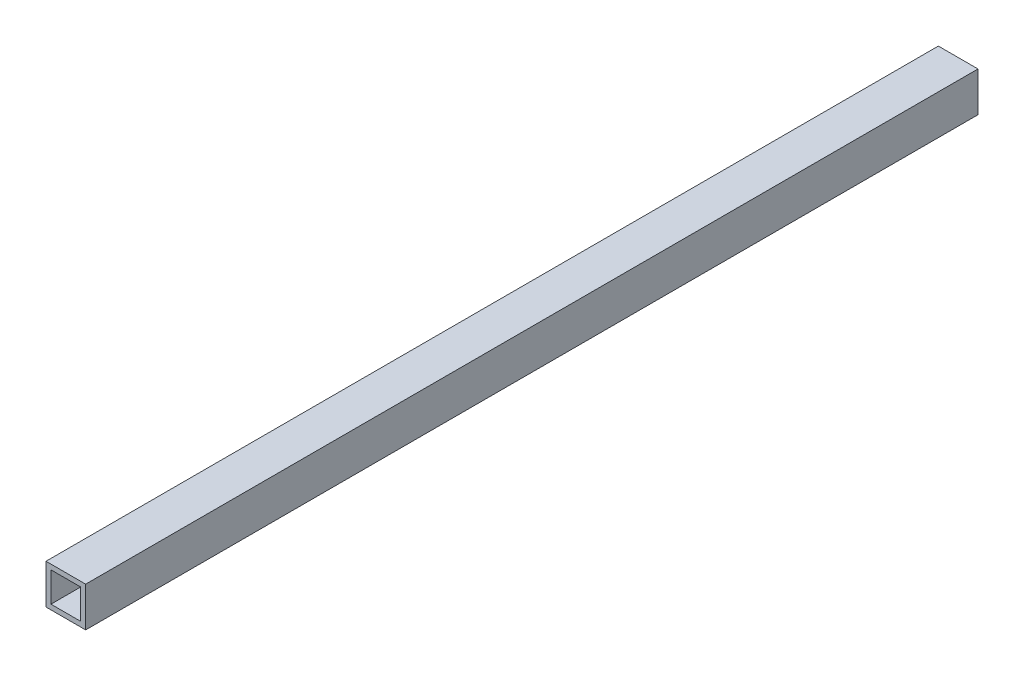
ISO-10303-21;
HEADER;
FILE_DESCRIPTION(('STEP AP214'),'2;1');
FILE_NAME('part.step','',(''),(''),'','','');
FILE_SCHEMA(('AUTOMOTIVE_DESIGN { 1 0 10303 214 1 1 1 1 }'));
ENDSEC;
DATA;
#1=APPLICATION_CONTEXT('core data for automotive mechanical design processes');
#2=APPLICATION_PROTOCOL_DEFINITION('international standard','automotive_design',2000,#1);
#3=PRODUCT_CONTEXT('',#1,'mechanical');
#4=PRODUCT('Part','Part','',(#3));
#5=PRODUCT_RELATED_PRODUCT_CATEGORY('part','',(#4));
#6=PRODUCT_DEFINITION_FORMATION('','',#4);
#7=PRODUCT_DEFINITION_CONTEXT('part definition',#1,'design');
#8=PRODUCT_DEFINITION('design','',#6,#7);
#9=PRODUCT_DEFINITION_SHAPE('','',#8);
#10=(LENGTH_UNIT() NAMED_UNIT(*) SI_UNIT(.MILLI.,.METRE.));
#11=(NAMED_UNIT(*) PLANE_ANGLE_UNIT() SI_UNIT($,.RADIAN.));
#12=(NAMED_UNIT(*) SI_UNIT($,.STERADIAN.) SOLID_ANGLE_UNIT());
#13=UNCERTAINTY_MEASURE_WITH_UNIT(LENGTH_MEASURE(1.E-05),#10,'distance_accuracy_value','');
#14=(GEOMETRIC_REPRESENTATION_CONTEXT(3) GLOBAL_UNCERTAINTY_ASSIGNED_CONTEXT((#13)) GLOBAL_UNIT_ASSIGNED_CONTEXT((#10,
#11,#12)) REPRESENTATION_CONTEXT('',''));
#15=CARTESIAN_POINT('',(0.,0.,0.));
#16=DIRECTION('',(0.,0.,1.));
#17=DIRECTION('',(1.,0.,0.));
#18=AXIS2_PLACEMENT_3D('',#15,#16,#17);
#19=CARTESIAN_POINT('',(9.525,9.525,0.));
#20=DIRECTION('',(1.,0.,0.));
#21=DIRECTION('',(0.,0.,-1.));
#22=AXIS2_PLACEMENT_3D('',#19,#20,#21);
#23=PLANE('',#22);
#24=DIRECTION('',(0.,-1.,0.));
#25=VECTOR('',#24,1.);
#26=CARTESIAN_POINT('',(9.525,4.7625,285.75));
#27=LINE('',#26,#25);
#28=CARTESIAN_POINT('',(9.525,9.525,285.75));
#29=VERTEX_POINT('',#28);
#30=CARTESIAN_POINT('',(9.525,-9.525,285.75));
#31=VERTEX_POINT('',#30);
#32=EDGE_CURVE('E34',#29,#31,#27,.T.);
#33=ORIENTED_EDGE('',*,*,#32,.F.);
#34=DIRECTION('',(0.,0.,-1.));
#35=VECTOR('',#34,1.);
#36=CARTESIAN_POINT('',(9.525,9.525,0.));
#37=LINE('',#36,#35);
#38=CARTESIAN_POINT('',(9.525,9.525,-285.75));
#39=VERTEX_POINT('',#38);
#40=EDGE_CURVE('E10',#29,#39,#37,.T.);
#41=ORIENTED_EDGE('',*,*,#40,.T.);
#42=DIRECTION('',(0.,1.,0.));
#43=VECTOR('',#42,1.);
#44=CARTESIAN_POINT('',(9.525,4.7625,-285.75));
#45=LINE('',#44,#43);
#46=CARTESIAN_POINT('',(9.525,-9.525,-285.75));
#47=VERTEX_POINT('',#46);
#48=EDGE_CURVE('E175',#47,#39,#45,.T.);
#49=ORIENTED_EDGE('',*,*,#48,.F.);
#50=DIRECTION('',(0.,0.,1.));
#51=VECTOR('',#50,1.);
#52=CARTESIAN_POINT('',(9.525,-9.525,0.));
#53=LINE('',#52,#51);
#54=EDGE_CURVE('E26',#47,#31,#53,.T.);
#55=ORIENTED_EDGE('',*,*,#54,.T.);
#56=EDGE_LOOP('',(#33,#41,#49,#55));
#57=FACE_BOUND('',#56,.T.);
#58=ADVANCED_FACE('F16',(#57),#23,.F.);
#59=CARTESIAN_POINT('',(9.525,-9.525,0.));
#60=DIRECTION('',(0.,-1.,0.));
#61=DIRECTION('',(0.,0.,-1.));
#62=AXIS2_PLACEMENT_3D('',#59,#60,#61);
#63=PLANE('',#62);
#64=DIRECTION('',(-1.,0.,0.));
#65=VECTOR('',#64,1.);
#66=CARTESIAN_POINT('',(4.7625,-9.525,285.75));
#67=LINE('',#66,#65);
#68=CARTESIAN_POINT('',(-9.525,-9.525,285.75));
#69=VERTEX_POINT('',#68);
#70=EDGE_CURVE('E166',#31,#69,#67,.T.);
#71=ORIENTED_EDGE('',*,*,#70,.F.);
#72=ORIENTED_EDGE('',*,*,#54,.F.);
#73=DIRECTION('',(1.,0.,0.));
#74=VECTOR('',#73,1.);
#75=CARTESIAN_POINT('',(4.7625,-9.525,-285.75));
#76=LINE('',#75,#74);
#77=CARTESIAN_POINT('',(-9.525,-9.525,-285.75));
#78=VERTEX_POINT('',#77);
#79=EDGE_CURVE('E117',#78,#47,#76,.T.);
#80=ORIENTED_EDGE('',*,*,#79,.F.);
#81=DIRECTION('',(0.,0.,1.));
#82=VECTOR('',#81,1.);
#83=CARTESIAN_POINT('',(-9.525,-9.525,0.));
#84=LINE('',#83,#82);
#85=EDGE_CURVE('E159',#78,#69,#84,.T.);
#86=ORIENTED_EDGE('',*,*,#85,.T.);
#87=EDGE_LOOP('',(#71,#72,#80,#86));
#88=FACE_BOUND('',#87,.T.);
#89=ADVANCED_FACE('F142',(#88),#63,.F.);
#90=CARTESIAN_POINT('',(-9.525,-9.525,0.));
#91=DIRECTION('',(-1.,0.,0.));
#92=DIRECTION('',(0.,0.,1.));
#93=AXIS2_PLACEMENT_3D('',#90,#91,#92);
#94=PLANE('',#93);
#95=DIRECTION('',(0.,1.,0.));
#96=VECTOR('',#95,1.);
#97=CARTESIAN_POINT('',(-9.525,-4.7625,285.75));
#98=LINE('',#97,#96);
#99=CARTESIAN_POINT('',(-9.525,9.525,285.75));
#100=VERTEX_POINT('',#99);
#101=EDGE_CURVE('E157',#69,#100,#98,.T.);
#102=ORIENTED_EDGE('',*,*,#101,.F.);
#103=ORIENTED_EDGE('',*,*,#85,.F.);
#104=DIRECTION('',(0.,-1.,0.));
#105=VECTOR('',#104,1.);
#106=CARTESIAN_POINT('',(-9.525,-4.7625,-285.75));
#107=LINE('',#106,#105);
#108=CARTESIAN_POINT('',(-9.525,9.525,-285.75));
#109=VERTEX_POINT('',#108);
#110=EDGE_CURVE('E121',#109,#78,#107,.T.);
#111=ORIENTED_EDGE('',*,*,#110,.F.);
#112=DIRECTION('',(0.,0.,1.));
#113=VECTOR('',#112,1.);
#114=CARTESIAN_POINT('',(-9.525,9.525,0.));
#115=LINE('',#114,#113);
#116=EDGE_CURVE('E162',#109,#100,#115,.T.);
#117=ORIENTED_EDGE('',*,*,#116,.T.);
#118=EDGE_LOOP('',(#102,#103,#111,#117));
#119=FACE_BOUND('',#118,.T.);
#120=ADVANCED_FACE('F138',(#119),#94,.F.);
#121=CARTESIAN_POINT('',(-9.525,9.525,0.));
#122=DIRECTION('',(0.,1.,0.));
#123=DIRECTION('',(0.,0.,1.));
#124=AXIS2_PLACEMENT_3D('',#121,#122,#123);
#125=PLANE('',#124);
#126=DIRECTION('',(1.,0.,0.));
#127=VECTOR('',#126,1.);
#128=CARTESIAN_POINT('',(-4.7625,9.525,285.75));
#129=LINE('',#128,#127);
#130=EDGE_CURVE('E167',#100,#29,#129,.T.);
#131=ORIENTED_EDGE('',*,*,#130,.F.);
#132=ORIENTED_EDGE('',*,*,#116,.F.);
#133=DIRECTION('',(-1.,0.,0.));
#134=VECTOR('',#133,1.);
#135=CARTESIAN_POINT('',(-4.7625,9.525,-285.75));
#136=LINE('',#135,#134);
#137=EDGE_CURVE('E174',#39,#109,#136,.T.);
#138=ORIENTED_EDGE('',*,*,#137,.F.);
#139=ORIENTED_EDGE('',*,*,#40,.F.);
#140=EDGE_LOOP('',(#131,#132,#138,#139));
#141=FACE_BOUND('',#140,.T.);
#142=ADVANCED_FACE('F128',(#141),#125,.F.);
#143=CARTESIAN_POINT('',(0.,0.,-285.75));
#144=DIRECTION('',(0.,0.,1.));
#145=DIRECTION('',(1.,0.,0.));
#146=AXIS2_PLACEMENT_3D('',#143,#144,#145);
#147=PLANE('',#146);
#148=ORIENTED_EDGE('',*,*,#48,.T.);
#149=ORIENTED_EDGE('',*,*,#137,.T.);
#150=ORIENTED_EDGE('',*,*,#110,.T.);
#151=ORIENTED_EDGE('',*,*,#79,.T.);
#152=EDGE_LOOP('',(#148,#149,#150,#151));
#153=FACE_BOUND('',#152,.T.);
#154=DIRECTION('',(0.,-1.,0.));
#155=VECTOR('',#154,1.);
#156=CARTESIAN_POINT('',(-12.7,-12.7,-285.75));
#157=LINE('',#156,#155);
#158=CARTESIAN_POINT('',(-12.7,12.7,-285.75));
#159=VERTEX_POINT('',#158);
#160=CARTESIAN_POINT('',(-12.7,-12.7,-285.75));
#161=VERTEX_POINT('',#160);
#162=EDGE_CURVE('E96',#159,#161,#157,.T.);
#163=ORIENTED_EDGE('',*,*,#162,.F.);
#164=DIRECTION('',(-1.,0.,0.));
#165=VECTOR('',#164,1.);
#166=CARTESIAN_POINT('',(-12.7,12.7,-285.75));
#167=LINE('',#166,#165);
#168=CARTESIAN_POINT('',(12.7,12.7,-285.75));
#169=VERTEX_POINT('',#168);
#170=EDGE_CURVE('E88',#169,#159,#167,.T.);
#171=ORIENTED_EDGE('',*,*,#170,.F.);
#172=DIRECTION('',(0.,1.,0.));
#173=VECTOR('',#172,1.);
#174=CARTESIAN_POINT('',(12.7,12.7,-285.75));
#175=LINE('',#174,#173);
#176=CARTESIAN_POINT('',(12.7,-12.7,-285.75));
#177=VERTEX_POINT('',#176);
#178=EDGE_CURVE('E111',#177,#169,#175,.T.);
#179=ORIENTED_EDGE('',*,*,#178,.F.);
#180=DIRECTION('',(1.,0.,0.));
#181=VECTOR('',#180,1.);
#182=CARTESIAN_POINT('',(12.7,-12.7,-285.75));
#183=LINE('',#182,#181);
#184=EDGE_CURVE('E95',#161,#177,#183,.T.);
#185=ORIENTED_EDGE('',*,*,#184,.F.);
#186=EDGE_LOOP('',(#163,#171,#179,#185));
#187=FACE_BOUND('',#186,.T.);
#188=ADVANCED_FACE('F126',(#153,#187),#147,.F.);
#189=CARTESIAN_POINT('',(12.7,12.7,0.));
#190=DIRECTION('',(1.,0.,0.));
#191=DIRECTION('',(0.,0.,-1.));
#192=AXIS2_PLACEMENT_3D('',#189,#190,#191);
#193=PLANE('',#192);
#194=DIRECTION('',(0.,-1.,0.));
#195=VECTOR('',#194,1.);
#196=CARTESIAN_POINT('',(12.7,12.7,285.75));
#197=LINE('',#196,#195);
#198=CARTESIAN_POINT('',(12.7,12.7,285.75));
#199=VERTEX_POINT('',#198);
#200=CARTESIAN_POINT('',(12.7,-12.7,285.75));
#201=VERTEX_POINT('',#200);
#202=EDGE_CURVE('E100',#199,#201,#197,.T.);
#203=ORIENTED_EDGE('',*,*,#202,.T.);
#204=DIRECTION('',(0.,0.,-1.));
#205=VECTOR('',#204,1.);
#206=CARTESIAN_POINT('',(12.7,-12.7,0.));
#207=LINE('',#206,#205);
#208=EDGE_CURVE('E107',#201,#177,#207,.T.);
#209=ORIENTED_EDGE('',*,*,#208,.T.);
#210=ORIENTED_EDGE('',*,*,#178,.T.);
#211=DIRECTION('',(0.,0.,-1.));
#212=VECTOR('',#211,1.);
#213=CARTESIAN_POINT('',(12.7,12.7,0.));
#214=LINE('',#213,#212);
#215=EDGE_CURVE('E101',#199,#169,#214,.T.);
#216=ORIENTED_EDGE('',*,*,#215,.F.);
#217=EDGE_LOOP('',(#203,#209,#210,#216));
#218=FACE_BOUND('',#217,.T.);
#219=ADVANCED_FACE('F124',(#218),#193,.T.);
#220=CARTESIAN_POINT('',(12.7,-12.7,0.));
#221=DIRECTION('',(0.,-1.,0.));
#222=DIRECTION('',(0.,0.,-1.));
#223=AXIS2_PLACEMENT_3D('',#220,#221,#222);
#224=PLANE('',#223);
#225=DIRECTION('',(-1.,0.,0.));
#226=VECTOR('',#225,1.);
#227=CARTESIAN_POINT('',(12.7,-12.7,285.75));
#228=LINE('',#227,#226);
#229=CARTESIAN_POINT('',(-12.7,-12.7,285.75));
#230=VERTEX_POINT('',#229);
#231=EDGE_CURVE('E109',#201,#230,#228,.T.);
#232=ORIENTED_EDGE('',*,*,#231,.T.);
#233=DIRECTION('',(0.,0.,-1.));
#234=VECTOR('',#233,1.);
#235=CARTESIAN_POINT('',(-12.7,-12.7,0.));
#236=LINE('',#235,#234);
#237=EDGE_CURVE('E78',#230,#161,#236,.T.);
#238=ORIENTED_EDGE('',*,*,#237,.T.);
#239=ORIENTED_EDGE('',*,*,#184,.T.);
#240=ORIENTED_EDGE('',*,*,#208,.F.);
#241=EDGE_LOOP('',(#232,#238,#239,#240));
#242=FACE_BOUND('',#241,.T.);
#243=ADVANCED_FACE('F136',(#242),#224,.T.);
#244=CARTESIAN_POINT('',(-12.7,-12.7,0.));
#245=DIRECTION('',(-1.,0.,0.));
#246=DIRECTION('',(0.,0.,1.));
#247=AXIS2_PLACEMENT_3D('',#244,#245,#246);
#248=PLANE('',#247);
#249=DIRECTION('',(0.,1.,0.));
#250=VECTOR('',#249,1.);
#251=CARTESIAN_POINT('',(-12.7,-12.7,285.75));
#252=LINE('',#251,#250);
#253=CARTESIAN_POINT('',(-12.7,12.7,285.75));
#254=VERTEX_POINT('',#253);
#255=EDGE_CURVE('E91',#230,#254,#252,.T.);
#256=ORIENTED_EDGE('',*,*,#255,.T.);
#257=DIRECTION('',(0.,0.,1.));
#258=VECTOR('',#257,1.);
#259=CARTESIAN_POINT('',(-12.7,12.7,0.));
#260=LINE('',#259,#258);
#261=EDGE_CURVE('E84',#159,#254,#260,.T.);
#262=ORIENTED_EDGE('',*,*,#261,.F.);
#263=ORIENTED_EDGE('',*,*,#162,.T.);
#264=ORIENTED_EDGE('',*,*,#237,.F.);
#265=EDGE_LOOP('',(#256,#262,#263,#264));
#266=FACE_BOUND('',#265,.T.);
#267=ADVANCED_FACE('F92',(#266),#248,.T.);
#268=CARTESIAN_POINT('',(-12.7,12.7,0.));
#269=DIRECTION('',(0.,1.,0.));
#270=DIRECTION('',(0.,0.,1.));
#271=AXIS2_PLACEMENT_3D('',#268,#269,#270);
#272=PLANE('',#271);
#273=DIRECTION('',(1.,0.,0.));
#274=VECTOR('',#273,1.);
#275=CARTESIAN_POINT('',(-12.7,12.7,285.75));
#276=LINE('',#275,#274);
#277=EDGE_CURVE('E20',#254,#199,#276,.T.);
#278=ORIENTED_EDGE('',*,*,#277,.T.);
#279=ORIENTED_EDGE('',*,*,#215,.T.);
#280=ORIENTED_EDGE('',*,*,#170,.T.);
#281=ORIENTED_EDGE('',*,*,#261,.T.);
#282=EDGE_LOOP('',(#278,#279,#280,#281));
#283=FACE_BOUND('',#282,.T.);
#284=ADVANCED_FACE('F85',(#283),#272,.T.);
#285=CARTESIAN_POINT('',(0.,0.,285.75));
#286=DIRECTION('',(0.,0.,1.));
#287=DIRECTION('',(1.,0.,0.));
#288=AXIS2_PLACEMENT_3D('',#285,#286,#287);
#289=PLANE('',#288);
#290=ORIENTED_EDGE('',*,*,#32,.T.);
#291=ORIENTED_EDGE('',*,*,#70,.T.);
#292=ORIENTED_EDGE('',*,*,#101,.T.);
#293=ORIENTED_EDGE('',*,*,#130,.T.);
#294=EDGE_LOOP('',(#290,#291,#292,#293));
#295=FACE_BOUND('',#294,.T.);
#296=ORIENTED_EDGE('',*,*,#202,.F.);
#297=ORIENTED_EDGE('',*,*,#277,.F.);
#298=ORIENTED_EDGE('',*,*,#255,.F.);
#299=ORIENTED_EDGE('',*,*,#231,.F.);
#300=EDGE_LOOP('',(#296,#297,#298,#299));
#301=FACE_BOUND('',#300,.T.);
#302=ADVANCED_FACE('F18',(#295,#301),#289,.T.);
#303=CLOSED_SHELL('',(#58,#89,#120,#142,#188,#219,#243,#267,#284,#302));
#304=MANIFOLD_SOLID_BREP('B1',#303);
#305=ADVANCED_BREP_SHAPE_REPRESENTATION('',(#18,#304),#14);
#306=SHAPE_DEFINITION_REPRESENTATION(#9,#305);
ENDSEC;
END-ISO-10303-21;
